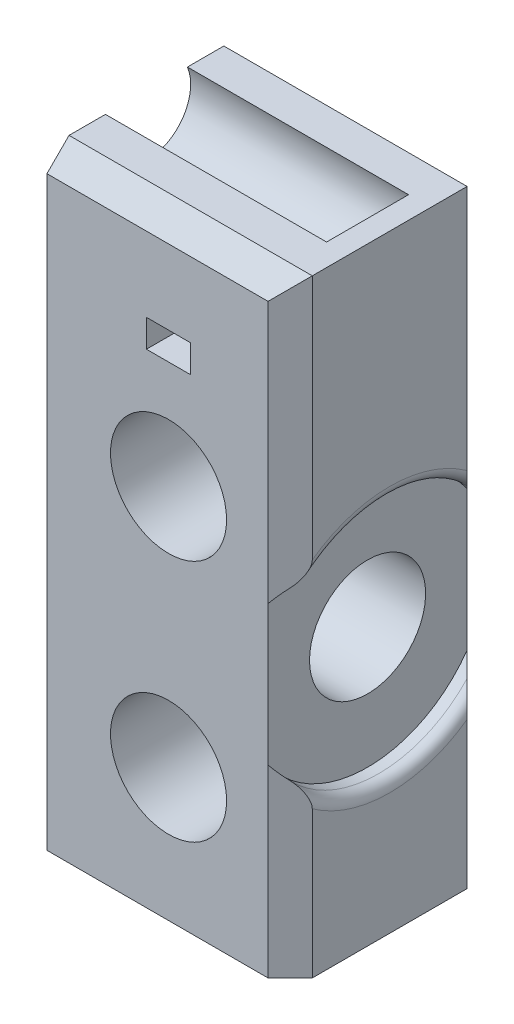
ISO-10303-21;
HEADER;
FILE_DESCRIPTION(('STEP AP214'),'2;1');
FILE_NAME('part.step','',(''),(''),'','','');
FILE_SCHEMA(('AUTOMOTIVE_DESIGN { 1 0 10303 214 1 1 1 1 }'));
ENDSEC;
DATA;
#1=APPLICATION_CONTEXT('core data for automotive mechanical design processes');
#2=APPLICATION_PROTOCOL_DEFINITION('international standard','automotive_design',2000,#1);
#3=PRODUCT_CONTEXT('',#1,'mechanical');
#4=PRODUCT('Part','Part','',(#3));
#5=PRODUCT_RELATED_PRODUCT_CATEGORY('part','',(#4));
#6=PRODUCT_DEFINITION_FORMATION('','',#4);
#7=PRODUCT_DEFINITION_CONTEXT('part definition',#1,'design');
#8=PRODUCT_DEFINITION('design','',#6,#7);
#9=PRODUCT_DEFINITION_SHAPE('','',#8);
#10=(LENGTH_UNIT() NAMED_UNIT(*) SI_UNIT(.MILLI.,.METRE.));
#11=(NAMED_UNIT(*) PLANE_ANGLE_UNIT() SI_UNIT($,.RADIAN.));
#12=(NAMED_UNIT(*) SI_UNIT($,.STERADIAN.) SOLID_ANGLE_UNIT());
#13=UNCERTAINTY_MEASURE_WITH_UNIT(LENGTH_MEASURE(1.E-05),#10,'distance_accuracy_value','');
#14=(GEOMETRIC_REPRESENTATION_CONTEXT(3) GLOBAL_UNCERTAINTY_ASSIGNED_CONTEXT((#13)) GLOBAL_UNIT_ASSIGNED_CONTEXT((#10,
#11,#12)) REPRESENTATION_CONTEXT('',''));
#15=CARTESIAN_POINT('',(0.,0.,0.));
#16=DIRECTION('',(0.,0.,1.));
#17=DIRECTION('',(1.,0.,0.));
#18=AXIS2_PLACEMENT_3D('',#15,#16,#17);
#19=CARTESIAN_POINT('',(22.,55.,-18.));
#20=DIRECTION('',(1.,0.,0.));
#21=DIRECTION('',(0.,1.,0.));
#22=AXIS2_PLACEMENT_3D('',#19,#20,#21);
#23=PLANE('',#22);
#24=DIRECTION('',(0.,1.,0.));
#25=VECTOR('',#24,1.);
#26=CARTESIAN_POINT('',(22.,55.,-16.));
#27=LINE('',#26,#25);
#28=CARTESIAN_POINT('',(22.,0.,-16.));
#29=VERTEX_POINT('',#28);
#30=CARTESIAN_POINT('',(22.,13.253205655191,-16.));
#31=VERTEX_POINT('',#30);
#32=EDGE_CURVE('E290',#29,#31,#27,.T.);
#33=ORIENTED_EDGE('',*,*,#32,.T.);
#34=CARTESIAN_POINT('',(22.,23.,-9.));
#35=DIRECTION('',(1.,0.,0.));
#36=DIRECTION('',(0.,1.,0.));
#37=AXIS2_PLACEMENT_3D('',#34,#35,#36);
#38=CIRCLE('',#37,12.);
#39=CARTESIAN_POINT('',(22.,13.253205655191,-2.));
#40=VERTEX_POINT('',#39);
#41=EDGE_CURVE('E345',#31,#40,#38,.F.);
#42=ORIENTED_EDGE('',*,*,#41,.T.);
#43=DIRECTION('',(0.,-1.,0.));
#44=VECTOR('',#43,1.);
#45=CARTESIAN_POINT('',(22.,0.,-2.));
#46=LINE('',#45,#44);
#47=CARTESIAN_POINT('',(22.,0.,-2.));
#48=VERTEX_POINT('',#47);
#49=EDGE_CURVE('E293',#40,#48,#46,.T.);
#50=ORIENTED_EDGE('',*,*,#49,.T.);
#51=DIRECTION('',(0.,0.,1.));
#52=VECTOR('',#51,1.);
#53=CARTESIAN_POINT('',(22.,0.,-18.));
#54=LINE('',#53,#52);
#55=EDGE_CURVE('E268',#29,#48,#54,.T.);
#56=ORIENTED_EDGE('',*,*,#55,.F.);
#57=EDGE_LOOP('',(#33,#42,#50,#56));
#58=FACE_BOUND('',#57,.T.);
#59=ADVANCED_FACE('F32',(#58),#23,.T.);
#60=CARTESIAN_POINT('',(22.,23.,-9.));
#61=DIRECTION('',(-1.,0.,0.));
#62=DIRECTION('',(0.,0.,1.));
#63=AXIS2_PLACEMENT_3D('',#60,#61,#62);
#64=CYLINDRICAL_SURFACE('',#63,5.25);
#65=CARTESIAN_POINT('',(0.,23.,-9.));
#66=DIRECTION('',(-1.,0.,0.));
#67=DIRECTION('',(0.,0.,1.));
#68=AXIS2_PLACEMENT_3D('',#65,#66,#67);
#69=CIRCLE('',#68,5.25);
#70=CARTESIAN_POINT('',(0.,23.,-3.75));
#71=VERTEX_POINT('',#70);
#72=EDGE_CURVE('E212',#71,#71,#69,.T.);
#73=ORIENTED_EDGE('',*,*,#72,.T.);
#74=EDGE_LOOP('',(#73));
#75=FACE_BOUND('',#74,.T.);
#76=CARTESIAN_POINT('',(20.,23.,-9.));
#77=DIRECTION('',(1.,0.,0.));
#78=DIRECTION('',(0.,1.,0.));
#79=AXIS2_PLACEMENT_3D('',#76,#77,#78);
#80=CIRCLE('',#79,5.25);
#81=CARTESIAN_POINT('',(20.,28.25,-9.));
#82=VERTEX_POINT('',#81);
#83=EDGE_CURVE('E203',#82,#82,#80,.F.);
#84=ORIENTED_EDGE('',*,*,#83,.F.);
#85=EDGE_LOOP('',(#84));
#86=FACE_BOUND('',#85,.T.);
#87=ADVANCED_FACE('F421',(#75,#86),#64,.F.);
#88=CARTESIAN_POINT('',(20.,0.,0.));
#89=DIRECTION('',(0.707106781186547,0.,0.707106781186547));
#90=DIRECTION('',(0.,-1.,0.));
#91=AXIS2_PLACEMENT_3D('',#88,#89,#90);
#92=PLANE('',#91);
#93=CARTESIAN_POINT('',(22.,55.,-2.));
#94=VERTEX_POINT('',#93);
#95=CARTESIAN_POINT('',(22.,32.746794344809,-2.));
#96=VERTEX_POINT('',#95);
#97=EDGE_CURVE('E294',#94,#96,#46,.T.);
#98=ORIENTED_EDGE('',*,*,#97,.F.);
#99=DIRECTION('',(-0.577350269189626,-0.577350269189626,0.577350269189626));
#100=VECTOR('',#99,1.);
#101=CARTESIAN_POINT('',(2.33333333333333,35.3333333333333,17.6666666666667));
#102=LINE('',#101,#100);
#103=CARTESIAN_POINT('',(20.,53.,0.));
#104=VERTEX_POINT('',#103);
#105=EDGE_CURVE('E192',#94,#104,#102,.T.);
#106=ORIENTED_EDGE('',*,*,#105,.T.);
#107=DIRECTION('',(0.,1.,0.));
#108=VECTOR('',#107,1.);
#109=CARTESIAN_POINT('',(20.,55.,0.));
#110=LINE('',#109,#108);
#111=CARTESIAN_POINT('',(20.,29.3245553203368,0.));
#112=VERTEX_POINT('',#111);
#113=EDGE_CURVE('E188',#112,#104,#110,.T.);
#114=ORIENTED_EDGE('',*,*,#113,.F.);
#115=CARTESIAN_POINT('',(29.,23.,-9.));
#116=DIRECTION('',(0.707106781186547,0.,0.707106781186547));
#117=DIRECTION('',(0.707106781186548,0.,-0.707106781186548));
#118=AXIS2_PLACEMENT_3D('',#115,#116,#117);
#119=ELLIPSE('',#118,15.556349186104,11.);
#120=CARTESIAN_POINT('',(21.,30.5498344352707,-1.));
#121=VERTEX_POINT('',#120);
#122=EDGE_CURVE('E162',#121,#112,#119,.T.);
#123=ORIENTED_EDGE('',*,*,#122,.F.);
#124=CARTESIAN_POINT('',(21.,30.5498344352707,-1.));
#125=CARTESIAN_POINT('',(21.0332176135886,30.585064994914,-1.03321761358859));
#126=CARTESIAN_POINT('',(21.0657876698333,30.6214904361269,-1.06578766983327));
#127=CARTESIAN_POINT('',(21.1296907284546,30.6964247989814,-1.12969072845465));
#128=CARTESIAN_POINT('',(21.1610241294047,30.7349330396946,-1.16102412940468));
#129=CARTESIAN_POINT('',(21.2225662198118,30.8137920041694,-1.22256621981178));
#130=CARTESIAN_POINT('',(21.2527736748636,30.8541446480475,-1.25277367486355));
#131=CARTESIAN_POINT('',(21.3120508322264,30.936491495134,-1.31205083222637));
#132=CARTESIAN_POINT('',(21.3411204143429,30.9784858708286,-1.34112041434287));
#133=CARTESIAN_POINT('',(21.4284872172308,31.1095504235047,-1.4284872172308));
#134=CARTESIAN_POINT('',(21.4849314885361,31.2011136728666,-1.4849314885361));
#135=CARTESIAN_POINT('',(21.5924553828394,31.3902900198901,-1.59245538283941));
#136=CARTESIAN_POINT('',(21.6435381199897,31.4878995526911,-1.64353811998971));
#137=CARTESIAN_POINT('',(21.7151613631439,31.6388504493364,-1.71516136314389));
#138=CARTESIAN_POINT('',(21.7381763382616,31.689856149284,-1.73817633826164));
#139=CARTESIAN_POINT('',(21.7823152121075,31.7934766769594,-1.78231521210748));
#140=CARTESIAN_POINT('',(21.8034394753193,31.8460911919112,-1.80343947531927));
#141=CARTESIAN_POINT('',(21.8432402072119,31.9523909218027,-1.84324020721191));
#142=CARTESIAN_POINT('',(21.8619415594864,32.0060574101105,-1.8619415594864));
#143=CARTESIAN_POINT('',(21.8967282497245,32.1150911017184,-1.89672824972446));
#144=CARTESIAN_POINT('',(21.912813262641,32.1704585153227,-1.912813262641));
#145=CARTESIAN_POINT('',(21.9379333744935,32.2681114008908,-1.93793337449351));
#146=CARTESIAN_POINT('',(21.9477105280514,32.3100135477502,-1.94771052805144));
#147=CARTESIAN_POINT('',(21.9651460272096,32.3946516707107,-1.96514602720966));
#148=CARTESIAN_POINT('',(21.9728066198218,32.437386710566,-1.97280661982184));
#149=CARTESIAN_POINT('',(21.9856804132807,32.5242125734738,-1.98568041328068));
#150=CARTESIAN_POINT('',(21.990859728662,32.5683138673928,-1.99085972866196));
#151=CARTESIAN_POINT('',(21.998011297161,32.6571729856846,-1.99801129716099));
#152=CARTESIAN_POINT('',(21.9999724442009,32.7019325480048,-1.99997244420087));
#153=CARTESIAN_POINT('',(22.0000000000003,32.7467943448088,-2.0000000000003));
#154=B_SPLINE_CURVE_WITH_KNOTS('',3,(#124,#125,#126,#127,#128,#129,#130,#131,#132,#133,#134,
#135,#136,#137,#138,#139,#140,#141,#142,#143,#144,#145,#146,#147,#148,#149,#150,#151,#152,#153),
.UNSPECIFIED.,.F.,.F.,(4,2,2,2,2,2,2,2,2,2,2,2,2,2,4),(0.,0.176116808033184,0.352176382297849,
0.528423614930732,0.704689414751418,1.06872647211663,1.43255090103852,1.61400469609854,
1.79542343555763,1.97479942559849,2.15419768384199,2.28647951427238,2.41862036550403,
2.55251769680534,2.68687615081373),.UNSPECIFIED.);
#155=EDGE_CURVE('E308',#121,#96,#154,.T.);
#156=ORIENTED_EDGE('',*,*,#155,.T.);
#157=EDGE_LOOP('',(#98,#106,#114,#123,#156));
#158=FACE_BOUND('',#157,.T.);
#159=ADVANCED_FACE('F190',(#158),#92,.T.);
#160=CARTESIAN_POINT('',(22.,55.,-16.));
#161=DIRECTION('',(-0.707106781186547,0.,0.707106781186547));
#162=DIRECTION('',(0.,1.,0.));
#163=AXIS2_PLACEMENT_3D('',#160,#161,#162);
#164=PLANE('',#163);
#165=CARTESIAN_POINT('',(29.,23.,-9.));
#166=DIRECTION('',(-0.707106781186547,0.,0.707106781186547));
#167=DIRECTION('',(0.707106781186548,0.,0.707106781186548));
#168=AXIS2_PLACEMENT_3D('',#165,#166,#167);
#169=ELLIPSE('',#168,15.556349186104,11.);
#170=CARTESIAN_POINT('',(21.,15.4501655647293,-17.));
#171=VERTEX_POINT('',#170);
#172=CARTESIAN_POINT('',(20.,16.6754446796632,-18.));
#173=VERTEX_POINT('',#172);
#174=EDGE_CURVE('E306',#171,#173,#169,.F.);
#175=ORIENTED_EDGE('',*,*,#174,.F.);
#176=CARTESIAN_POINT('',(21.,15.4501655647293,-17.));
#177=CARTESIAN_POINT('',(21.0332176135886,15.414935005086,-16.9667823864114));
#178=CARTESIAN_POINT('',(21.0657876698333,15.3785095638731,-16.9342123301667));
#179=CARTESIAN_POINT('',(21.1296907284546,15.3035752010186,-16.8703092715454));
#180=CARTESIAN_POINT('',(21.1610241294047,15.2650669603054,-16.8389758705953));
#181=CARTESIAN_POINT('',(21.2225662198118,15.1862079958306,-16.7774337801882));
#182=CARTESIAN_POINT('',(21.2527736748636,15.1458553519525,-16.7472263251364));
#183=CARTESIAN_POINT('',(21.3120508322264,15.063508504866,-16.6879491677736));
#184=CARTESIAN_POINT('',(21.3411204143429,15.0215141291714,-16.6588795856571));
#185=CARTESIAN_POINT('',(21.4284872172308,14.8904495764953,-16.5715127827692));
#186=CARTESIAN_POINT('',(21.4849314885361,14.7988863271334,-16.5150685114639));
#187=CARTESIAN_POINT('',(21.5924553828394,14.6097099801099,-16.4075446171606));
#188=CARTESIAN_POINT('',(21.6435381199897,14.5121004473089,-16.3564618800103));
#189=CARTESIAN_POINT('',(21.7151613631439,14.3611495506636,-16.2848386368561));
#190=CARTESIAN_POINT('',(21.7381763382616,14.310143850716,-16.2618236617384));
#191=CARTESIAN_POINT('',(21.7823152121075,14.2065233230406,-16.2176847878925));
#192=CARTESIAN_POINT('',(21.8034394753193,14.1539088080888,-16.1965605246807));
#193=CARTESIAN_POINT('',(21.8432402072119,14.0476090781973,-16.1567597927881));
#194=CARTESIAN_POINT('',(21.8619415594864,13.9939425898895,-16.1380584405136));
#195=CARTESIAN_POINT('',(21.8967282497245,13.8849088982816,-16.1032717502755));
#196=CARTESIAN_POINT('',(21.912813262641,13.8295414846773,-16.087186737359));
#197=CARTESIAN_POINT('',(21.9379333744935,13.7318885991092,-16.0620666255065));
#198=CARTESIAN_POINT('',(21.9477105280514,13.6899864522498,-16.0522894719486));
#199=CARTESIAN_POINT('',(21.9651460272097,13.6053483292893,-16.0348539727903));
#200=CARTESIAN_POINT('',(21.9728066198218,13.562613289434,-16.0271933801782));
#201=CARTESIAN_POINT('',(21.9856804132807,13.4757874265262,-16.0143195867193));
#202=CARTESIAN_POINT('',(21.990859728662,13.4316861326072,-16.009140271338));
#203=CARTESIAN_POINT('',(21.998011297161,13.3428270143154,-16.001988702839));
#204=CARTESIAN_POINT('',(21.9999724442009,13.2980674519952,-16.0000275557991));
#205=CARTESIAN_POINT('',(22.0000000000003,13.2532056551912,-15.9999999999997));
#206=B_SPLINE_CURVE_WITH_KNOTS('',3,(#176,#177,#178,#179,#180,#181,#182,#183,#184,#185,#186,
#187,#188,#189,#190,#191,#192,#193,#194,#195,#196,#197,#198,#199,#200,#201,#202,#203,#204,#205),
.UNSPECIFIED.,.F.,.F.,(4,2,2,2,2,2,2,2,2,2,2,2,2,2,4),(0.,0.176116808033185,0.35217638229785,
0.528423614930733,0.70468941475142,1.06872647211664,1.43255090103853,1.61400469609854,
1.79542343555763,1.9747994255985,2.154197683842,2.28647951427239,2.41862036550404,
2.55251769680535,2.68687615081374),.UNSPECIFIED.);
#207=EDGE_CURVE('E340',#171,#31,#206,.T.);
#208=ORIENTED_EDGE('',*,*,#207,.T.);
#209=ORIENTED_EDGE('',*,*,#32,.F.);
#210=DIRECTION('',(-0.707106781186548,0.,-0.707106781186548));
#211=VECTOR('',#210,1.);
#212=CARTESIAN_POINT('',(21.,0.,-17.));
#213=LINE('',#212,#211);
#214=CARTESIAN_POINT('',(20.,0.,-18.));
#215=VERTEX_POINT('',#214);
#216=EDGE_CURVE('E297',#215,#29,#213,.F.);
#217=ORIENTED_EDGE('',*,*,#216,.F.);
#218=DIRECTION('',(0.,-1.,0.));
#219=VECTOR('',#218,1.);
#220=CARTESIAN_POINT('',(20.,0.,-18.));
#221=LINE('',#220,#219);
#222=EDGE_CURVE('E301',#173,#215,#221,.T.);
#223=ORIENTED_EDGE('',*,*,#222,.F.);
#224=EDGE_LOOP('',(#175,#208,#209,#217,#223));
#225=FACE_BOUND('',#224,.T.);
#226=ADVANCED_FACE('F395',(#225),#164,.F.);
#227=CARTESIAN_POINT('',(0.,0.,-18.));
#228=DIRECTION('',(-1.,0.,0.));
#229=DIRECTION('',(0.,0.,1.));
#230=AXIS2_PLACEMENT_3D('',#227,#228,#229);
#231=PLANE('',#230);
#232=ORIENTED_EDGE('',*,*,#72,.F.);
#233=EDGE_LOOP('',(#232));
#234=FACE_BOUND('',#233,.T.);
#235=DIRECTION('',(0.,-1.,0.));
#236=VECTOR('',#235,1.);
#237=CARTESIAN_POINT('',(0.,0.,0.));
#238=LINE('',#237,#236);
#239=CARTESIAN_POINT('',(0.,53.,0.));
#240=VERTEX_POINT('',#239);
#241=CARTESIAN_POINT('',(0.,0.,0.));
#242=VERTEX_POINT('',#241);
#243=EDGE_CURVE('E266',#240,#242,#238,.T.);
#244=ORIENTED_EDGE('',*,*,#243,.F.);
#245=DIRECTION('',(0.,0.707106781186548,-0.707106781186548));
#246=VECTOR('',#245,1.);
#247=CARTESIAN_POINT('',(0.,35.5,17.5));
#248=LINE('',#247,#246);
#249=CARTESIAN_POINT('',(0.,55.,-2.00000000000001));
#250=VERTEX_POINT('',#249);
#251=EDGE_CURVE('E355',#240,#250,#248,.T.);
#252=ORIENTED_EDGE('',*,*,#251,.T.);
#253=DIRECTION('',(0.,0.,1.));
#254=VECTOR('',#253,1.);
#255=CARTESIAN_POINT('',(0.,55.,-18.));
#256=LINE('',#255,#254);
#257=CARTESIAN_POINT('',(0.,55.,-5.29190075645216));
#258=VERTEX_POINT('',#257);
#259=EDGE_CURVE('E277',#258,#250,#256,.T.);
#260=ORIENTED_EDGE('',*,*,#259,.F.);
#261=CARTESIAN_POINT('',(0.,53.5,-9.));
#262=DIRECTION('',(1.,0.,0.));
#263=DIRECTION('',(0.,0.,-1.));
#264=AXIS2_PLACEMENT_3D('',#261,#262,#263);
#265=CIRCLE('',#264,4.00000000000001);
#266=CARTESIAN_POINT('',(0.,55.,-12.7080992435478));
#267=VERTEX_POINT('',#266);
#268=EDGE_CURVE('E172',#258,#267,#265,.T.);
#269=ORIENTED_EDGE('',*,*,#268,.T.);
#270=CARTESIAN_POINT('',(0.,55.,-16.));
#271=VERTEX_POINT('',#270);
#272=EDGE_CURVE('E275',#271,#267,#256,.T.);
#273=ORIENTED_EDGE('',*,*,#272,.F.);
#274=DIRECTION('',(0.,0.707106781186548,0.707106781186548));
#275=VECTOR('',#274,1.);
#276=CARTESIAN_POINT('',(0.,26.5,-44.5));
#277=LINE('',#276,#275);
#278=CARTESIAN_POINT('',(0.,53.,-18.));
#279=VERTEX_POINT('',#278);
#280=EDGE_CURVE('E54',#271,#279,#277,.F.);
#281=ORIENTED_EDGE('',*,*,#280,.T.);
#282=DIRECTION('',(0.,-1.,0.));
#283=VECTOR('',#282,1.);
#284=CARTESIAN_POINT('',(0.,0.,-18.));
#285=LINE('',#284,#283);
#286=CARTESIAN_POINT('',(0.,0.,-18.));
#287=VERTEX_POINT('',#286);
#288=EDGE_CURVE('E265',#279,#287,#285,.T.);
#289=ORIENTED_EDGE('',*,*,#288,.T.);
#290=DIRECTION('',(0.,0.,1.));
#291=VECTOR('',#290,1.);
#292=CARTESIAN_POINT('',(0.,0.,-18.));
#293=LINE('',#292,#291);
#294=EDGE_CURVE('E271',#287,#242,#293,.T.);
#295=ORIENTED_EDGE('',*,*,#294,.T.);
#296=EDGE_LOOP('',(#244,#252,#260,#269,#273,#281,#289,#295));
#297=FACE_BOUND('',#296,.T.);
#298=ADVANCED_FACE('F377',(#234,#297),#231,.T.);
#299=CARTESIAN_POINT('',(0.,55.,-18.));
#300=DIRECTION('',(0.,1.,0.));
#301=DIRECTION('',(0.,0.,1.));
#302=AXIS2_PLACEMENT_3D('',#299,#300,#301);
#303=PLANE('',#302);
#304=ORIENTED_EDGE('',*,*,#259,.T.);
#305=DIRECTION('',(1.,0.,0.));
#306=VECTOR('',#305,1.);
#307=CARTESIAN_POINT('',(20.,55.,-2.00000000000001));
#308=LINE('',#307,#306);
#309=EDGE_CURVE('E360',#250,#94,#308,.T.);
#310=ORIENTED_EDGE('',*,*,#309,.T.);
#311=DIRECTION('',(0.,0.,1.));
#312=VECTOR('',#311,1.);
#313=CARTESIAN_POINT('',(22.,55.,-18.));
#314=LINE('',#313,#312);
#315=CARTESIAN_POINT('',(22.,55.,-16.));
#316=VERTEX_POINT('',#315);
#317=EDGE_CURVE('E278',#316,#94,#314,.T.);
#318=ORIENTED_EDGE('',*,*,#317,.F.);
#319=DIRECTION('',(-1.,0.,0.));
#320=VECTOR('',#319,1.);
#321=CARTESIAN_POINT('',(0.,55.,-16.));
#322=LINE('',#321,#320);
#323=EDGE_CURVE('E357',#316,#271,#322,.T.);
#324=ORIENTED_EDGE('',*,*,#323,.T.);
#325=ORIENTED_EDGE('',*,*,#272,.T.);
#326=DIRECTION('',(-1.,0.,0.));
#327=VECTOR('',#326,1.);
#328=CARTESIAN_POINT('',(20.,55.,-12.7080992435478));
#329=LINE('',#328,#327);
#330=CARTESIAN_POINT('',(20.,55.,-12.7080992435478));
#331=VERTEX_POINT('',#330);
#332=EDGE_CURVE('E197',#267,#331,#329,.F.);
#333=ORIENTED_EDGE('',*,*,#332,.T.);
#334=DIRECTION('',(0.,0.,-1.));
#335=VECTOR('',#334,1.);
#336=CARTESIAN_POINT('',(20.,55.,-18.));
#337=LINE('',#336,#335);
#338=CARTESIAN_POINT('',(20.,55.,-5.29190075645216));
#339=VERTEX_POINT('',#338);
#340=EDGE_CURVE('E274',#339,#331,#337,.T.);
#341=ORIENTED_EDGE('',*,*,#340,.F.);
#342=DIRECTION('',(-1.,0.,0.));
#343=VECTOR('',#342,1.);
#344=CARTESIAN_POINT('',(20.,55.,-5.29190075645216));
#345=LINE('',#344,#343);
#346=EDGE_CURVE('E284',#339,#258,#345,.T.);
#347=ORIENTED_EDGE('',*,*,#346,.T.);
#348=EDGE_LOOP('',(#304,#310,#318,#324,#325,#333,#341,#347));
#349=FACE_BOUND('',#348,.T.);
#350=ADVANCED_FACE('F366',(#349),#303,.T.);
#351=CARTESIAN_POINT('',(22.,0.,-18.));
#352=DIRECTION('',(0.,-1.,0.));
#353=DIRECTION('',(1.,0.,0.));
#354=AXIS2_PLACEMENT_3D('',#351,#352,#353);
#355=PLANE('',#354);
#356=ORIENTED_EDGE('',*,*,#55,.T.);
#357=DIRECTION('',(-0.707106781186548,0.,0.707106781186548));
#358=VECTOR('',#357,1.);
#359=CARTESIAN_POINT('',(30.,0.,-10.));
#360=LINE('',#359,#358);
#361=CARTESIAN_POINT('',(20.,0.,0.));
#362=VERTEX_POINT('',#361);
#363=EDGE_CURVE('E299',#48,#362,#360,.T.);
#364=ORIENTED_EDGE('',*,*,#363,.T.);
#365=DIRECTION('',(1.,0.,0.));
#366=VECTOR('',#365,1.);
#367=CARTESIAN_POINT('',(22.,0.,0.));
#368=LINE('',#367,#366);
#369=EDGE_CURVE('E259',#242,#362,#368,.T.);
#370=ORIENTED_EDGE('',*,*,#369,.F.);
#371=ORIENTED_EDGE('',*,*,#294,.F.);
#372=DIRECTION('',(1.,0.,0.));
#373=VECTOR('',#372,1.);
#374=CARTESIAN_POINT('',(22.,0.,-18.));
#375=LINE('',#374,#373);
#376=EDGE_CURVE('E262',#287,#215,#375,.T.);
#377=ORIENTED_EDGE('',*,*,#376,.T.);
#378=ORIENTED_EDGE('',*,*,#216,.T.);
#379=EDGE_LOOP('',(#356,#364,#370,#371,#377,#378));
#380=FACE_BOUND('',#379,.T.);
#381=ADVANCED_FACE('F382',(#380),#355,.T.);
#382=ORIENTED_EDGE('',*,*,#97,.T.);
#383=CARTESIAN_POINT('',(22.,23.,-9.));
#384=DIRECTION('',(1.,0.,0.));
#385=DIRECTION('',(0.,1.,0.));
#386=AXIS2_PLACEMENT_3D('',#383,#384,#385);
#387=CIRCLE('',#386,12.);
#388=CARTESIAN_POINT('',(22.,32.746794344809,-16.));
#389=VERTEX_POINT('',#388);
#390=EDGE_CURVE('E315',#96,#389,#387,.F.);
#391=ORIENTED_EDGE('',*,*,#390,.T.);
#392=EDGE_CURVE('E289',#389,#316,#27,.T.);
#393=ORIENTED_EDGE('',*,*,#392,.T.);
#394=ORIENTED_EDGE('',*,*,#317,.T.);
#395=EDGE_LOOP('',(#382,#391,#393,#394));
#396=FACE_BOUND('',#395,.T.);
#397=ADVANCED_FACE('F372',(#396),#23,.T.);
#398=CARTESIAN_POINT('',(0.,0.,-18.));
#399=DIRECTION('',(0.,0.,-1.));
#400=DIRECTION('',(-1.,0.,0.));
#401=AXIS2_PLACEMENT_3D('',#398,#399,#400);
#402=PLANE('',#401);
#403=DIRECTION('',(0.,-1.,0.));
#404=VECTOR('',#403,1.);
#405=CARTESIAN_POINT('',(9.,43.75,-18.));
#406=LINE('',#405,#404);
#407=CARTESIAN_POINT('',(9.,46.25,-18.));
#408=VERTEX_POINT('',#407);
#409=CARTESIAN_POINT('',(9.,43.75,-18.));
#410=VERTEX_POINT('',#409);
#411=EDGE_CURVE('E218',#408,#410,#406,.T.);
#412=ORIENTED_EDGE('',*,*,#411,.T.);
#413=DIRECTION('',(1.,0.,0.));
#414=VECTOR('',#413,1.);
#415=CARTESIAN_POINT('',(13.,43.75,-18.));
#416=LINE('',#415,#414);
#417=CARTESIAN_POINT('',(13.,43.75,-18.));
#418=VERTEX_POINT('',#417);
#419=EDGE_CURVE('E221',#410,#418,#416,.T.);
#420=ORIENTED_EDGE('',*,*,#419,.T.);
#421=DIRECTION('',(0.,1.,0.));
#422=VECTOR('',#421,1.);
#423=CARTESIAN_POINT('',(13.,43.75,-18.));
#424=LINE('',#423,#422);
#425=CARTESIAN_POINT('',(13.,46.25,-18.));
#426=VERTEX_POINT('',#425);
#427=EDGE_CURVE('E225',#418,#426,#424,.T.);
#428=ORIENTED_EDGE('',*,*,#427,.T.);
#429=DIRECTION('',(-1.,0.,0.));
#430=VECTOR('',#429,1.);
#431=CARTESIAN_POINT('',(13.,46.25,-18.));
#432=LINE('',#431,#430);
#433=EDGE_CURVE('E228',#426,#408,#432,.T.);
#434=ORIENTED_EDGE('',*,*,#433,.T.);
#435=EDGE_LOOP('',(#412,#420,#428,#434));
#436=FACE_BOUND('',#435,.T.);
#437=CARTESIAN_POINT('',(11.,34.,-18.));
#438=DIRECTION('',(0.,0.,1.));
#439=DIRECTION('',(1.,0.,0.));
#440=AXIS2_PLACEMENT_3D('',#437,#438,#439);
#441=CIRCLE('',#440,5.25);
#442=CARTESIAN_POINT('',(16.25,34.,-18.));
#443=VERTEX_POINT('',#442);
#444=EDGE_CURVE('E250',#443,#443,#441,.T.);
#445=ORIENTED_EDGE('',*,*,#444,.T.);
#446=EDGE_LOOP('',(#445));
#447=FACE_BOUND('',#446,.T.);
#448=CARTESIAN_POINT('',(11.,12.,-18.));
#449=DIRECTION('',(0.,0.,1.));
#450=DIRECTION('',(1.,0.,0.));
#451=AXIS2_PLACEMENT_3D('',#448,#449,#450);
#452=CIRCLE('',#451,5.25);
#453=CARTESIAN_POINT('',(16.25,12.,-18.));
#454=VERTEX_POINT('',#453);
#455=EDGE_CURVE('E256',#454,#454,#452,.T.);
#456=ORIENTED_EDGE('',*,*,#455,.T.);
#457=EDGE_LOOP('',(#456));
#458=FACE_BOUND('',#457,.T.);
#459=ORIENTED_EDGE('',*,*,#288,.F.);
#460=DIRECTION('',(1.,0.,0.));
#461=VECTOR('',#460,1.);
#462=CARTESIAN_POINT('',(0.,53.,-18.));
#463=LINE('',#462,#461);
#464=CARTESIAN_POINT('',(20.,53.,-18.));
#465=VERTEX_POINT('',#464);
#466=EDGE_CURVE('E40',#279,#465,#463,.T.);
#467=ORIENTED_EDGE('',*,*,#466,.T.);
#468=CARTESIAN_POINT('',(20.,29.3245553203368,-18.));
#469=VERTEX_POINT('',#468);
#470=EDGE_CURVE('E302',#465,#469,#221,.T.);
#471=ORIENTED_EDGE('',*,*,#470,.T.);
#472=EDGE_CURVE('E184',#469,#173,#221,.T.);
#473=ORIENTED_EDGE('',*,*,#472,.T.);
#474=ORIENTED_EDGE('',*,*,#222,.T.);
#475=ORIENTED_EDGE('',*,*,#376,.F.);
#476=EDGE_LOOP('',(#459,#467,#471,#473,#474,#475));
#477=FACE_BOUND('',#476,.T.);
#478=ADVANCED_FACE('F400',(#436,#447,#458,#477),#402,.T.);
#479=CARTESIAN_POINT('',(0.,0.,0.));
#480=DIRECTION('',(0.,0.,-1.));
#481=DIRECTION('',(-1.,0.,0.));
#482=AXIS2_PLACEMENT_3D('',#479,#480,#481);
#483=PLANE('',#482);
#484=DIRECTION('',(1.,0.,0.));
#485=VECTOR('',#484,1.);
#486=CARTESIAN_POINT('',(13.,43.75,0.));
#487=LINE('',#486,#485);
#488=CARTESIAN_POINT('',(9.,43.75,0.));
#489=VERTEX_POINT('',#488);
#490=CARTESIAN_POINT('',(13.,43.75,0.));
#491=VERTEX_POINT('',#490);
#492=EDGE_CURVE('E233',#489,#491,#487,.T.);
#493=ORIENTED_EDGE('',*,*,#492,.F.);
#494=DIRECTION('',(0.,-1.,0.));
#495=VECTOR('',#494,1.);
#496=CARTESIAN_POINT('',(9.,43.75,0.));
#497=LINE('',#496,#495);
#498=CARTESIAN_POINT('',(9.,46.25,0.));
#499=VERTEX_POINT('',#498);
#500=EDGE_CURVE('E217',#499,#489,#497,.T.);
#501=ORIENTED_EDGE('',*,*,#500,.F.);
#502=DIRECTION('',(-1.,0.,0.));
#503=VECTOR('',#502,1.);
#504=CARTESIAN_POINT('',(13.,46.25,0.));
#505=LINE('',#504,#503);
#506=CARTESIAN_POINT('',(13.,46.25,0.));
#507=VERTEX_POINT('',#506);
#508=EDGE_CURVE('E222',#507,#499,#505,.T.);
#509=ORIENTED_EDGE('',*,*,#508,.F.);
#510=DIRECTION('',(0.,1.,0.));
#511=VECTOR('',#510,1.);
#512=CARTESIAN_POINT('',(13.,43.75,0.));
#513=LINE('',#512,#511);
#514=EDGE_CURVE('E236',#491,#507,#513,.T.);
#515=ORIENTED_EDGE('',*,*,#514,.F.);
#516=EDGE_LOOP('',(#493,#501,#509,#515));
#517=FACE_BOUND('',#516,.T.);
#518=CARTESIAN_POINT('',(11.,34.,0.));
#519=DIRECTION('',(0.,0.,1.));
#520=DIRECTION('',(1.,0.,0.));
#521=AXIS2_PLACEMENT_3D('',#518,#519,#520);
#522=CIRCLE('',#521,5.25);
#523=CARTESIAN_POINT('',(16.25,34.,0.));
#524=VERTEX_POINT('',#523);
#525=EDGE_CURVE('E243',#524,#524,#522,.T.);
#526=ORIENTED_EDGE('',*,*,#525,.F.);
#527=EDGE_LOOP('',(#526));
#528=FACE_BOUND('',#527,.T.);
#529=CARTESIAN_POINT('',(11.,12.,0.));
#530=DIRECTION('',(0.,0.,1.));
#531=DIRECTION('',(1.,0.,0.));
#532=AXIS2_PLACEMENT_3D('',#529,#530,#531);
#533=CIRCLE('',#532,5.25);
#534=CARTESIAN_POINT('',(16.25,12.,0.));
#535=VERTEX_POINT('',#534);
#536=EDGE_CURVE('E253',#535,#535,#533,.T.);
#537=ORIENTED_EDGE('',*,*,#536,.F.);
#538=EDGE_LOOP('',(#537));
#539=FACE_BOUND('',#538,.T.);
#540=ORIENTED_EDGE('',*,*,#113,.T.);
#541=DIRECTION('',(-1.,0.,0.));
#542=VECTOR('',#541,1.);
#543=CARTESIAN_POINT('',(0.,53.,0.));
#544=LINE('',#543,#542);
#545=EDGE_CURVE('E352',#104,#240,#544,.T.);
#546=ORIENTED_EDGE('',*,*,#545,.T.);
#547=ORIENTED_EDGE('',*,*,#243,.T.);
#548=ORIENTED_EDGE('',*,*,#369,.T.);
#549=CARTESIAN_POINT('',(20.,16.6754446796632,0.));
#550=VERTEX_POINT('',#549);
#551=EDGE_CURVE('E196',#362,#550,#110,.T.);
#552=ORIENTED_EDGE('',*,*,#551,.T.);
#553=DIRECTION('',(0.,1.,0.));
#554=VECTOR('',#553,1.);
#555=CARTESIAN_POINT('',(20.,0.,0.));
#556=LINE('',#555,#554);
#557=EDGE_CURVE('E181',#550,#112,#556,.T.);
#558=ORIENTED_EDGE('',*,*,#557,.T.);
#559=EDGE_LOOP('',(#540,#546,#547,#548,#552,#558));
#560=FACE_BOUND('',#559,.T.);
#561=ADVANCED_FACE('F200',(#517,#528,#539,#560),#483,.F.);
#562=CARTESIAN_POINT('',(11.,12.,-18.));
#563=DIRECTION('',(0.,0.,1.));
#564=DIRECTION('',(1.,0.,0.));
#565=AXIS2_PLACEMENT_3D('',#562,#563,#564);
#566=CYLINDRICAL_SURFACE('',#565,5.25);
#567=ORIENTED_EDGE('',*,*,#455,.F.);
#568=EDGE_LOOP('',(#567));
#569=FACE_BOUND('',#568,.T.);
#570=ORIENTED_EDGE('',*,*,#536,.T.);
#571=EDGE_LOOP('',(#570));
#572=FACE_BOUND('',#571,.T.);
#573=ADVANCED_FACE('F446',(#569,#572),#566,.F.);
#574=CARTESIAN_POINT('',(11.,34.,-18.));
#575=DIRECTION('',(0.,0.,1.));
#576=DIRECTION('',(1.,0.,0.));
#577=AXIS2_PLACEMENT_3D('',#574,#575,#576);
#578=CYLINDRICAL_SURFACE('',#577,5.25);
#579=ORIENTED_EDGE('',*,*,#444,.F.);
#580=EDGE_LOOP('',(#579));
#581=FACE_BOUND('',#580,.T.);
#582=ORIENTED_EDGE('',*,*,#525,.T.);
#583=EDGE_LOOP('',(#582));
#584=FACE_BOUND('',#583,.T.);
#585=ADVANCED_FACE('F451',(#581,#584),#578,.F.);
#586=CARTESIAN_POINT('',(9.,43.75,-18.));
#587=DIRECTION('',(-1.,0.,0.));
#588=DIRECTION('',(0.,0.,1.));
#589=AXIS2_PLACEMENT_3D('',#586,#587,#588);
#590=PLANE('',#589);
#591=ORIENTED_EDGE('',*,*,#500,.T.);
#592=DIRECTION('',(0.,0.,1.));
#593=VECTOR('',#592,1.);
#594=CARTESIAN_POINT('',(9.,43.75,-18.));
#595=LINE('',#594,#593);
#596=EDGE_CURVE('E231',#410,#489,#595,.T.);
#597=ORIENTED_EDGE('',*,*,#596,.F.);
#598=ORIENTED_EDGE('',*,*,#411,.F.);
#599=DIRECTION('',(0.,0.,1.));
#600=VECTOR('',#599,1.);
#601=CARTESIAN_POINT('',(9.,46.25,-18.));
#602=LINE('',#601,#600);
#603=EDGE_CURVE('E241',#408,#499,#602,.T.);
#604=ORIENTED_EDGE('',*,*,#603,.T.);
#605=EDGE_LOOP('',(#591,#597,#598,#604));
#606=FACE_BOUND('',#605,.T.);
#607=ADVANCED_FACE('F455',(#606),#590,.F.);
#608=CARTESIAN_POINT('',(13.,46.25,-18.));
#609=DIRECTION('',(0.,1.,0.));
#610=DIRECTION('',(0.,0.,1.));
#611=AXIS2_PLACEMENT_3D('',#608,#609,#610);
#612=PLANE('',#611);
#613=ORIENTED_EDGE('',*,*,#508,.T.);
#614=ORIENTED_EDGE('',*,*,#603,.F.);
#615=ORIENTED_EDGE('',*,*,#433,.F.);
#616=DIRECTION('',(0.,0.,1.));
#617=VECTOR('',#616,1.);
#618=CARTESIAN_POINT('',(13.,46.25,-18.));
#619=LINE('',#618,#617);
#620=EDGE_CURVE('E244',#426,#507,#619,.T.);
#621=ORIENTED_EDGE('',*,*,#620,.T.);
#622=EDGE_LOOP('',(#613,#614,#615,#621));
#623=FACE_BOUND('',#622,.T.);
#624=ADVANCED_FACE('F459',(#623),#612,.F.);
#625=CARTESIAN_POINT('',(13.,43.75,-18.));
#626=DIRECTION('',(1.,0.,0.));
#627=DIRECTION('',(0.,0.,-1.));
#628=AXIS2_PLACEMENT_3D('',#625,#626,#627);
#629=PLANE('',#628);
#630=ORIENTED_EDGE('',*,*,#514,.T.);
#631=ORIENTED_EDGE('',*,*,#620,.F.);
#632=ORIENTED_EDGE('',*,*,#427,.F.);
#633=DIRECTION('',(0.,0.,1.));
#634=VECTOR('',#633,1.);
#635=CARTESIAN_POINT('',(13.,43.75,-18.));
#636=LINE('',#635,#634);
#637=EDGE_CURVE('E246',#418,#491,#636,.T.);
#638=ORIENTED_EDGE('',*,*,#637,.T.);
#639=EDGE_LOOP('',(#630,#631,#632,#638));
#640=FACE_BOUND('',#639,.T.);
#641=ADVANCED_FACE('F463',(#640),#629,.F.);
#642=CARTESIAN_POINT('',(13.,43.75,-18.));
#643=DIRECTION('',(0.,-1.,0.));
#644=DIRECTION('',(0.,0.,-1.));
#645=AXIS2_PLACEMENT_3D('',#642,#643,#644);
#646=PLANE('',#645);
#647=ORIENTED_EDGE('',*,*,#492,.T.);
#648=ORIENTED_EDGE('',*,*,#637,.F.);
#649=ORIENTED_EDGE('',*,*,#419,.F.);
#650=ORIENTED_EDGE('',*,*,#596,.T.);
#651=EDGE_LOOP('',(#647,#648,#649,#650));
#652=FACE_BOUND('',#651,.T.);
#653=ADVANCED_FACE('F417',(#652),#646,.F.);
#654=CARTESIAN_POINT('',(20.,53.5,-9.));
#655=DIRECTION('',(-1.,0.,0.));
#656=DIRECTION('',(0.,0.,1.));
#657=AXIS2_PLACEMENT_3D('',#654,#655,#656);
#658=CYLINDRICAL_SURFACE('',#657,4.00000000000001);
#659=ORIENTED_EDGE('',*,*,#268,.F.);
#660=ORIENTED_EDGE('',*,*,#346,.F.);
#661=CARTESIAN_POINT('',(20.,53.5,-9.));
#662=DIRECTION('',(1.,0.,0.));
#663=DIRECTION('',(0.,0.,-1.));
#664=AXIS2_PLACEMENT_3D('',#661,#662,#663);
#665=CIRCLE('',#664,4.00000000000001);
#666=EDGE_CURVE('E209',#339,#331,#665,.T.);
#667=ORIENTED_EDGE('',*,*,#666,.T.);
#668=ORIENTED_EDGE('',*,*,#332,.F.);
#669=EDGE_LOOP('',(#659,#660,#667,#668));
#670=FACE_BOUND('',#669,.T.);
#671=ADVANCED_FACE('F407',(#670),#658,.F.);
#672=CARTESIAN_POINT('',(20.,53.5,-9.));
#673=DIRECTION('',(1.,0.,0.));
#674=DIRECTION('',(0.,0.,-1.));
#675=AXIS2_PLACEMENT_3D('',#672,#673,#674);
#676=PLANE('',#675);
#677=ORIENTED_EDGE('',*,*,#340,.T.);
#678=ORIENTED_EDGE('',*,*,#666,.F.);
#679=EDGE_LOOP('',(#677,#678));
#680=FACE_BOUND('',#679,.T.);
#681=ADVANCED_FACE('F410',(#680),#676,.F.);
#682=ORIENTED_EDGE('',*,*,#49,.F.);
#683=CARTESIAN_POINT('',(22.,13.253205655191,-2.));
#684=CARTESIAN_POINT('',(21.9999766560589,13.2962494065844,-1.99997665605888));
#685=CARTESIAN_POINT('',(21.998168932567,13.3392046752749,-1.99816893256702));
#686=CARTESIAN_POINT('',(21.9915552740378,13.4245221746565,-1.99155527403784));
#687=CARTESIAN_POINT('',(21.9867591186859,13.4668858807151,-1.98675911868589));
#688=CARTESIAN_POINT('',(21.9748086996764,13.5503501680223,-1.9748086996764));
#689=CARTESIAN_POINT('',(21.9676854202024,13.5914599774481,-1.96768542020239));
#690=CARTESIAN_POINT('',(21.9514453132439,13.672921209684,-1.9514453132439));
#691=CARTESIAN_POINT('',(21.9423263790877,13.7132717817659,-1.94232637908766));
#692=CARTESIAN_POINT('',(21.9147003673617,13.8240830671392,-1.91470036736176));
#693=CARTESIAN_POINT('',(21.894393919011,13.8936478109954,-1.89439391901098));
#694=CARTESIAN_POINT('',(21.8497664484496,14.0301221547315,-1.84976644844958));
#695=CARTESIAN_POINT('',(21.825443875575,14.097030716608,-1.82544387557505));
#696=CARTESIAN_POINT('',(21.773230307304,14.2292233628306,-1.77323030730403));
#697=CARTESIAN_POINT('',(21.745293972196,14.2944714096261,-1.74529397219603));
#698=CARTESIAN_POINT('',(21.6866995403245,14.4224549238955,-1.68669954032451));
#699=CARTESIAN_POINT('',(21.6560414777441,14.4851904229111,-1.65604147774414));
#700=CARTESIAN_POINT('',(21.5794002500722,14.6333387857842,-1.57940025007221));
#701=CARTESIAN_POINT('',(21.532267142803,14.717563060593,-1.53226714280303));
#702=CARTESIAN_POINT('',(21.4339923432625,14.8812081236913,-1.43399234326249));
#703=CARTESIAN_POINT('',(21.3828501468935,14.960628305689,-1.38285014689354));
#704=CARTESIAN_POINT('',(21.3041551442489,15.0746009576611,-1.30415514424889));
#705=CARTESIAN_POINT('',(21.2780448503946,15.1111619630403,-1.27804485039457));
#706=CARTESIAN_POINT('',(21.2249304815896,15.182959076026,-1.22493048158956));
#707=CARTESIAN_POINT('',(21.1979264852834,15.2181952996316,-1.19792648528338));
#708=CARTESIAN_POINT('',(21.1430075043079,15.2872078811779,-1.14300750430787));
#709=CARTESIAN_POINT('',(21.1150926855419,15.3209845024041,-1.11509268554193));
#710=CARTESIAN_POINT('',(21.0582885241414,15.3868773390111,-1.05828852414139));
#711=CARTESIAN_POINT('',(21.0293989201956,15.4189931032271,-1.02939892019566));
#712=CARTESIAN_POINT('',(21.0000000000019,15.4501655647312,-1.00000000000186));
#713=B_SPLINE_CURVE_WITH_KNOTS('',3,(#683,#684,#685,#686,#687,#688,#689,#690,#691,#692,#693,
#694,#695,#696,#697,#698,#699,#700,#701,#702,#703,#704,#705,#706,#707,#708,#709,#710,#711,#712),
.UNSPECIFIED.,.F.,.F.,(4,2,2,2,2,2,2,2,2,2,2,2,2,2,4),(0.,0.128932655520978,0.257445577252772,
0.38431277755064,0.511314554203528,0.736726127634834,0.962224939014591,1.1908923769881,
1.41955694345176,1.74149862121284,2.06348084462767,2.21934538260824,2.37519624101844,
2.53101886844988,2.68688360447958),.UNSPECIFIED.);
#714=CARTESIAN_POINT('',(21.,15.4501655647293,-0.999999999999992));
#715=VERTEX_POINT('',#714);
#716=EDGE_CURVE('E347',#40,#715,#713,.T.);
#717=ORIENTED_EDGE('',*,*,#716,.T.);
#718=EDGE_CURVE('E173',#550,#715,#119,.T.);
#719=ORIENTED_EDGE('',*,*,#718,.F.);
#720=ORIENTED_EDGE('',*,*,#551,.F.);
#721=ORIENTED_EDGE('',*,*,#363,.F.);
#722=EDGE_LOOP('',(#682,#717,#719,#720,#721));
#723=FACE_BOUND('',#722,.T.);
#724=ADVANCED_FACE('F317',(#723),#92,.T.);
#725=ORIENTED_EDGE('',*,*,#470,.F.);
#726=DIRECTION('',(0.577350269189626,0.577350269189626,0.577350269189626));
#727=VECTOR('',#726,1.);
#728=CARTESIAN_POINT('',(22.,55.,-16.));
#729=LINE('',#728,#727);
#730=EDGE_CURVE('E11',#465,#316,#729,.T.);
#731=ORIENTED_EDGE('',*,*,#730,.T.);
#732=ORIENTED_EDGE('',*,*,#392,.F.);
#733=CARTESIAN_POINT('',(22.,32.746794344809,-16.));
#734=CARTESIAN_POINT('',(21.9999766560589,32.7037505934156,-16.0000233439411));
#735=CARTESIAN_POINT('',(21.998168932567,32.6607953247251,-16.001831067433));
#736=CARTESIAN_POINT('',(21.9915552740378,32.5754778253435,-16.0084447259622));
#737=CARTESIAN_POINT('',(21.9867591186859,32.5331141192849,-16.0132408813141));
#738=CARTESIAN_POINT('',(21.9748086996764,32.4496498319777,-16.0251913003236));
#739=CARTESIAN_POINT('',(21.9676854202024,32.4085400225519,-16.0323145797976));
#740=CARTESIAN_POINT('',(21.9514453132439,32.327078790316,-16.0485546867561));
#741=CARTESIAN_POINT('',(21.9423263790877,32.2867282182341,-16.0576736209123));
#742=CARTESIAN_POINT('',(21.9147003673617,32.1759169328608,-16.0852996326382));
#743=CARTESIAN_POINT('',(21.894393919011,32.1063521890046,-16.105606080989));
#744=CARTESIAN_POINT('',(21.8497664484496,31.9698778452685,-16.1502335515504));
#745=CARTESIAN_POINT('',(21.825443875575,31.902969283392,-16.174556124425));
#746=CARTESIAN_POINT('',(21.773230307304,31.7707766371694,-16.226769692696));
#747=CARTESIAN_POINT('',(21.745293972196,31.7055285903739,-16.254706027804));
#748=CARTESIAN_POINT('',(21.6866995403245,31.5775450761045,-16.3133004596755));
#749=CARTESIAN_POINT('',(21.6560414777441,31.5148095770889,-16.3439585222559));
#750=CARTESIAN_POINT('',(21.5794002500722,31.3666612142158,-16.4205997499278));
#751=CARTESIAN_POINT('',(21.532267142803,31.282436939407,-16.467732857197));
#752=CARTESIAN_POINT('',(21.4339923432625,31.1187918763087,-16.5660076567375));
#753=CARTESIAN_POINT('',(21.3828501468935,31.039371694311,-16.6171498531065));
#754=CARTESIAN_POINT('',(21.3041551442489,30.9253990423389,-16.6958448557511));
#755=CARTESIAN_POINT('',(21.2780448503946,30.8888380369597,-16.7219551496054));
#756=CARTESIAN_POINT('',(21.2249304815896,30.817040923974,-16.7750695184104));
#757=CARTESIAN_POINT('',(21.1979264852834,30.7818047003684,-16.8020735147166));
#758=CARTESIAN_POINT('',(21.1430075043079,30.7127921188221,-16.8569924956921));
#759=CARTESIAN_POINT('',(21.1150926855419,30.6790154975959,-16.8849073144581));
#760=CARTESIAN_POINT('',(21.0582885241414,30.6131226609889,-16.9417114758586));
#761=CARTESIAN_POINT('',(21.0293989201957,30.5810068967729,-16.9706010798043));
#762=CARTESIAN_POINT('',(21.0000000000019,30.5498344352688,-16.9999999999981));
#763=B_SPLINE_CURVE_WITH_KNOTS('',3,(#733,#734,#735,#736,#737,#738,#739,#740,#741,#742,#743,
#744,#745,#746,#747,#748,#749,#750,#751,#752,#753,#754,#755,#756,#757,#758,#759,#760,#761,#762),
.UNSPECIFIED.,.F.,.F.,(4,2,2,2,2,2,2,2,2,2,2,2,2,2,4),(0.,0.12893265552098,0.257445577252776,
0.384312777550635,0.511314554203528,0.736726127634841,0.9622249390146,1.19089237698811,
1.41955694345176,1.74149862121284,2.06348084462767,2.21934538260823,2.37519624101844,
2.53101886844987,2.68688360447958),.UNSPECIFIED.);
#764=CARTESIAN_POINT('',(21.,30.5498344352707,-17.));
#765=VERTEX_POINT('',#764);
#766=EDGE_CURVE('E332',#389,#765,#763,.T.);
#767=ORIENTED_EDGE('',*,*,#766,.T.);
#768=EDGE_CURVE('E304',#469,#765,#169,.F.);
#769=ORIENTED_EDGE('',*,*,#768,.F.);
#770=EDGE_LOOP('',(#725,#731,#732,#767,#769));
#771=FACE_BOUND('',#770,.T.);
#772=ADVANCED_FACE('F328',(#771),#164,.F.);
#773=CARTESIAN_POINT('',(20.,23.,-9.));
#774=DIRECTION('',(1.,0.,0.));
#775=DIRECTION('',(0.,1.,0.));
#776=AXIS2_PLACEMENT_3D('',#773,#774,#775);
#777=CYLINDRICAL_SURFACE('',#776,11.);
#778=ORIENTED_EDGE('',*,*,#768,.T.);
#779=CARTESIAN_POINT('',(21.,23.,-9.));
#780=DIRECTION('',(1.,0.,0.));
#781=DIRECTION('',(0.,1.,0.));
#782=AXIS2_PLACEMENT_3D('',#779,#780,#781);
#783=CIRCLE('',#782,11.);
#784=EDGE_CURVE('E169',#765,#121,#783,.T.);
#785=ORIENTED_EDGE('',*,*,#784,.T.);
#786=ORIENTED_EDGE('',*,*,#122,.T.);
#787=CARTESIAN_POINT('',(20.,23.,-9.));
#788=DIRECTION('',(1.,0.,0.));
#789=DIRECTION('',(0.,1.,0.));
#790=AXIS2_PLACEMENT_3D('',#787,#788,#789);
#791=CIRCLE('',#790,11.);
#792=EDGE_CURVE('E166',#469,#112,#791,.T.);
#793=ORIENTED_EDGE('',*,*,#792,.F.);
#794=EDGE_LOOP('',(#778,#785,#786,#793));
#795=FACE_BOUND('',#794,.T.);
#796=ADVANCED_FACE('F165',(#795),#777,.F.);
#797=CARTESIAN_POINT('',(20.,23.,-9.));
#798=DIRECTION('',(1.,0.,0.));
#799=DIRECTION('',(0.,1.,0.));
#800=AXIS2_PLACEMENT_3D('',#797,#798,#799);
#801=PLANE('',#800);
#802=EDGE_CURVE('E185',#550,#173,#791,.T.);
#803=ORIENTED_EDGE('',*,*,#802,.T.);
#804=ORIENTED_EDGE('',*,*,#472,.F.);
#805=ORIENTED_EDGE('',*,*,#792,.T.);
#806=ORIENTED_EDGE('',*,*,#557,.F.);
#807=EDGE_LOOP('',(#803,#804,#805,#806));
#808=FACE_BOUND('',#807,.T.);
#809=ORIENTED_EDGE('',*,*,#83,.T.);
#810=EDGE_LOOP('',(#809));
#811=FACE_BOUND('',#810,.T.);
#812=ADVANCED_FACE('F178',(#808,#811),#801,.T.);
#813=ORIENTED_EDGE('',*,*,#718,.T.);
#814=CARTESIAN_POINT('',(21.,23.,-9.));
#815=DIRECTION('',(1.,0.,0.));
#816=DIRECTION('',(0.,1.,0.));
#817=AXIS2_PLACEMENT_3D('',#814,#815,#816);
#818=CIRCLE('',#817,11.);
#819=EDGE_CURVE('E337',#715,#171,#818,.T.);
#820=ORIENTED_EDGE('',*,*,#819,.T.);
#821=ORIENTED_EDGE('',*,*,#174,.T.);
#822=ORIENTED_EDGE('',*,*,#802,.F.);
#823=EDGE_LOOP('',(#813,#820,#821,#822));
#824=FACE_BOUND('',#823,.T.);
#825=ADVANCED_FACE('F326',(#824),#777,.F.);
#826=CARTESIAN_POINT('',(21.,23.,-9.));
#827=DIRECTION('',(1.,0.,0.));
#828=DIRECTION('',(0.,1.,0.));
#829=AXIS2_PLACEMENT_3D('',#826,#827,#828);
#830=TOROIDAL_SURFACE('',#829,12.,1.);
#831=ORIENTED_EDGE('',*,*,#766,.F.);
#832=ORIENTED_EDGE('',*,*,#390,.F.);
#833=ORIENTED_EDGE('',*,*,#155,.F.);
#834=ORIENTED_EDGE('',*,*,#784,.F.);
#835=EDGE_LOOP('',(#831,#832,#833,#834));
#836=FACE_BOUND('',#835,.T.);
#837=ADVANCED_FACE('F321',(#836),#830,.T.);
#838=CARTESIAN_POINT('',(21.,23.,-9.));
#839=DIRECTION('',(1.,0.,0.));
#840=DIRECTION('',(0.,1.,0.));
#841=AXIS2_PLACEMENT_3D('',#838,#839,#840);
#842=TOROIDAL_SURFACE('',#841,12.,1.);
#843=ORIENTED_EDGE('',*,*,#716,.F.);
#844=ORIENTED_EDGE('',*,*,#41,.F.);
#845=ORIENTED_EDGE('',*,*,#207,.F.);
#846=ORIENTED_EDGE('',*,*,#819,.F.);
#847=EDGE_LOOP('',(#843,#844,#845,#846));
#848=FACE_BOUND('',#847,.T.);
#849=ADVANCED_FACE('F325',(#848),#842,.T.);
#850=CARTESIAN_POINT('',(0.,53.,0.));
#851=DIRECTION('',(0.,0.707106781186548,0.707106781186548));
#852=DIRECTION('',(1.,0.,0.));
#853=AXIS2_PLACEMENT_3D('',#850,#851,#852);
#854=PLANE('',#853);
#855=ORIENTED_EDGE('',*,*,#105,.F.);
#856=ORIENTED_EDGE('',*,*,#309,.F.);
#857=ORIENTED_EDGE('',*,*,#251,.F.);
#858=ORIENTED_EDGE('',*,*,#545,.F.);
#859=EDGE_LOOP('',(#855,#856,#857,#858));
#860=FACE_BOUND('',#859,.T.);
#861=ADVANCED_FACE('F375',(#860),#854,.T.);
#862=CARTESIAN_POINT('',(0.,55.,-16.));
#863=DIRECTION('',(0.,-0.707106781186547,0.707106781186547));
#864=DIRECTION('',(-1.,0.,0.));
#865=AXIS2_PLACEMENT_3D('',#862,#863,#864);
#866=PLANE('',#865);
#867=ORIENTED_EDGE('',*,*,#730,.F.);
#868=ORIENTED_EDGE('',*,*,#466,.F.);
#869=ORIENTED_EDGE('',*,*,#280,.F.);
#870=ORIENTED_EDGE('',*,*,#323,.F.);
#871=EDGE_LOOP('',(#867,#868,#869,#870));
#872=FACE_BOUND('',#871,.T.);
#873=ADVANCED_FACE('F34',(#872),#866,.F.);
#874=CLOSED_SHELL('',(#59,#87,#159,#226,#298,#350,#381,#397,#478,#561,#573,#585,#607,#624,#641,
#653,#671,#681,#724,#772,#796,#812,#825,#837,#849,#861,#873));
#875=MANIFOLD_SOLID_BREP('B2',#874);
#876=ADVANCED_BREP_SHAPE_REPRESENTATION('',(#18,#875),#14);
#877=SHAPE_DEFINITION_REPRESENTATION(#9,#876);
ENDSEC;
END-ISO-10303-21;
